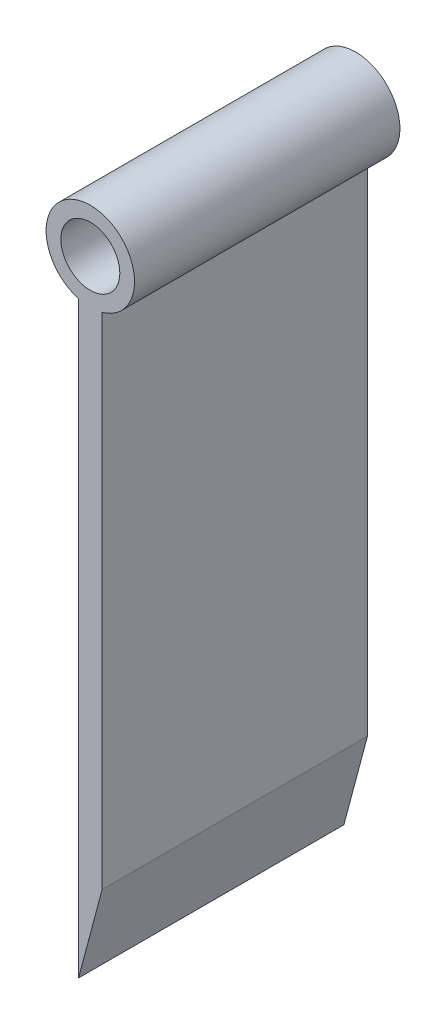
ISO-10303-21;
HEADER;
FILE_DESCRIPTION(('STEP AP214'),'2;1');
FILE_NAME('part.step','',(''),(''),'','','');
FILE_SCHEMA(('AUTOMOTIVE_DESIGN { 1 0 10303 214 1 1 1 1 }'));
ENDSEC;
DATA;
#1=APPLICATION_CONTEXT('core data for automotive mechanical design processes');
#2=APPLICATION_PROTOCOL_DEFINITION('international standard','automotive_design',2000,#1);
#3=PRODUCT_CONTEXT('',#1,'mechanical');
#4=PRODUCT('Part','Part','',(#3));
#5=PRODUCT_RELATED_PRODUCT_CATEGORY('part','',(#4));
#6=PRODUCT_DEFINITION_FORMATION('','',#4);
#7=PRODUCT_DEFINITION_CONTEXT('part definition',#1,'design');
#8=PRODUCT_DEFINITION('design','',#6,#7);
#9=PRODUCT_DEFINITION_SHAPE('','',#8);
#10=(LENGTH_UNIT() NAMED_UNIT(*) SI_UNIT(.MILLI.,.METRE.));
#11=(NAMED_UNIT(*) PLANE_ANGLE_UNIT() SI_UNIT($,.RADIAN.));
#12=(NAMED_UNIT(*) SI_UNIT($,.STERADIAN.) SOLID_ANGLE_UNIT());
#13=UNCERTAINTY_MEASURE_WITH_UNIT(LENGTH_MEASURE(1.E-05),#10,'distance_accuracy_value','');
#14=(GEOMETRIC_REPRESENTATION_CONTEXT(3) GLOBAL_UNCERTAINTY_ASSIGNED_CONTEXT((#13)) GLOBAL_UNIT_ASSIGNED_CONTEXT((#10,
#11,#12)) REPRESENTATION_CONTEXT('',''));
#15=CARTESIAN_POINT('',(0.,0.,0.));
#16=DIRECTION('',(0.,0.,1.));
#17=DIRECTION('',(1.,0.,0.));
#18=AXIS2_PLACEMENT_3D('',#15,#16,#17);
#19=CARTESIAN_POINT('',(1.,53.5,22.5));
#20=DIRECTION('',(0.,0.,-1.));
#21=DIRECTION('',(-1.,0.,0.));
#22=AXIS2_PLACEMENT_3D('',#19,#20,#21);
#23=CYLINDRICAL_SURFACE('',#22,3.75);
#24=CARTESIAN_POINT('',(1.,53.5,0.));
#25=DIRECTION('',(0.,0.,1.));
#26=DIRECTION('',(1.,0.,0.));
#27=AXIS2_PLACEMENT_3D('',#24,#25,#26);
#28=CIRCLE('',#27,3.75);
#29=CARTESIAN_POINT('',(2.,49.8857919262998,0.));
#30=VERTEX_POINT('',#29);
#31=CARTESIAN_POINT('',(0.,49.8857919262998,0.));
#32=VERTEX_POINT('',#31);
#33=EDGE_CURVE('E102',#30,#32,#28,.T.);
#34=ORIENTED_EDGE('',*,*,#33,.T.);
#35=DIRECTION('',(0.,0.,-1.));
#36=VECTOR('',#35,1.);
#37=CARTESIAN_POINT('',(0.,49.8857919262998,22.5));
#38=LINE('',#37,#36);
#39=CARTESIAN_POINT('',(0.,49.8857919262998,22.5));
#40=VERTEX_POINT('',#39);
#41=EDGE_CURVE('E11',#40,#32,#38,.T.);
#42=ORIENTED_EDGE('',*,*,#41,.F.);
#43=CARTESIAN_POINT('',(1.,53.5,22.5));
#44=DIRECTION('',(0.,0.,1.));
#45=DIRECTION('',(1.,0.,0.));
#46=AXIS2_PLACEMENT_3D('',#43,#44,#45);
#47=CIRCLE('',#46,3.75);
#48=CARTESIAN_POINT('',(2.,49.8857919262998,22.5));
#49=VERTEX_POINT('',#48);
#50=EDGE_CURVE('E76',#49,#40,#47,.T.);
#51=ORIENTED_EDGE('',*,*,#50,.F.);
#52=DIRECTION('',(0.,0.,-1.));
#53=VECTOR('',#52,1.);
#54=CARTESIAN_POINT('',(2.,49.8857919262998,22.5));
#55=LINE('',#54,#53);
#56=EDGE_CURVE('E52',#49,#30,#55,.T.);
#57=ORIENTED_EDGE('',*,*,#56,.T.);
#58=EDGE_LOOP('',(#34,#42,#51,#57));
#59=FACE_BOUND('',#58,.T.);
#60=ADVANCED_FACE('F35',(#59),#23,.T.);
#61=CARTESIAN_POINT('',(0.,0.,22.5));
#62=DIRECTION('',(-1.,0.,0.));
#63=DIRECTION('',(0.,0.,1.));
#64=AXIS2_PLACEMENT_3D('',#61,#62,#63);
#65=PLANE('',#64);
#66=DIRECTION('',(0.,1.,0.));
#67=VECTOR('',#66,1.);
#68=CARTESIAN_POINT('',(0.,0.,0.));
#69=LINE('',#68,#67);
#70=CARTESIAN_POINT('',(0.,0.,0.));
#71=VERTEX_POINT('',#70);
#72=EDGE_CURVE('E85',#71,#32,#69,.T.);
#73=ORIENTED_EDGE('',*,*,#72,.F.);
#74=DIRECTION('',(0.,0.,-1.));
#75=VECTOR('',#74,1.);
#76=CARTESIAN_POINT('',(0.,0.,22.5));
#77=LINE('',#76,#75);
#78=CARTESIAN_POINT('',(0.,0.,22.5));
#79=VERTEX_POINT('',#78);
#80=EDGE_CURVE('E44',#79,#71,#77,.T.);
#81=ORIENTED_EDGE('',*,*,#80,.F.);
#82=DIRECTION('',(0.,1.,0.));
#83=VECTOR('',#82,1.);
#84=CARTESIAN_POINT('',(0.,0.,22.5));
#85=LINE('',#84,#83);
#86=EDGE_CURVE('E83',#79,#40,#85,.T.);
#87=ORIENTED_EDGE('',*,*,#86,.T.);
#88=ORIENTED_EDGE('',*,*,#41,.T.);
#89=EDGE_LOOP('',(#73,#81,#87,#88));
#90=FACE_BOUND('',#89,.T.);
#91=ADVANCED_FACE('F82',(#90),#65,.T.);
#92=CARTESIAN_POINT('',(0.,0.,22.5));
#93=DIRECTION('',(0.966234939601246,-0.257662650560333,0.));
#94=DIRECTION('',(0.257662650560333,0.966234939601246,0.));
#95=AXIS2_PLACEMENT_3D('',#92,#93,#94);
#96=PLANE('',#95);
#97=DIRECTION('',(-0.257662650560333,-0.966234939601246,0.));
#98=VECTOR('',#97,1.);
#99=CARTESIAN_POINT('',(0.,0.,0.));
#100=LINE('',#99,#98);
#101=CARTESIAN_POINT('',(2.00000000000001,7.50000000000001,0.));
#102=VERTEX_POINT('',#101);
#103=EDGE_CURVE('E105',#102,#71,#100,.T.);
#104=ORIENTED_EDGE('',*,*,#103,.F.);
#105=DIRECTION('',(0.,0.,-1.));
#106=VECTOR('',#105,1.);
#107=CARTESIAN_POINT('',(2.00000000000001,7.50000000000001,22.5));
#108=LINE('',#107,#106);
#109=CARTESIAN_POINT('',(2.00000000000001,7.50000000000001,22.5));
#110=VERTEX_POINT('',#109);
#111=EDGE_CURVE('E65',#110,#102,#108,.T.);
#112=ORIENTED_EDGE('',*,*,#111,.F.);
#113=DIRECTION('',(-0.257662650560333,-0.966234939601246,0.));
#114=VECTOR('',#113,1.);
#115=CARTESIAN_POINT('',(0.,0.,22.5));
#116=LINE('',#115,#114);
#117=EDGE_CURVE('E91',#110,#79,#116,.T.);
#118=ORIENTED_EDGE('',*,*,#117,.T.);
#119=ORIENTED_EDGE('',*,*,#80,.T.);
#120=EDGE_LOOP('',(#104,#112,#118,#119));
#121=FACE_BOUND('',#120,.T.);
#122=ADVANCED_FACE('F93',(#121),#96,.T.);
#123=CARTESIAN_POINT('',(1.,53.5,22.5));
#124=DIRECTION('',(0.,0.,-1.));
#125=DIRECTION('',(-1.,0.,0.));
#126=AXIS2_PLACEMENT_3D('',#123,#124,#125);
#127=CYLINDRICAL_SURFACE('',#126,2.5);
#128=CARTESIAN_POINT('',(1.,53.5,22.5));
#129=DIRECTION('',(0.,0.,1.));
#130=DIRECTION('',(1.,0.,0.));
#131=AXIS2_PLACEMENT_3D('',#128,#129,#130);
#132=CIRCLE('',#131,2.5);
#133=CARTESIAN_POINT('',(3.5,53.5,22.5));
#134=VERTEX_POINT('',#133);
#135=EDGE_CURVE('E110',#134,#134,#132,.T.);
#136=ORIENTED_EDGE('',*,*,#135,.T.);
#137=EDGE_LOOP('',(#136));
#138=FACE_BOUND('',#137,.T.);
#139=CARTESIAN_POINT('',(1.,53.5,0.));
#140=DIRECTION('',(0.,0.,1.));
#141=DIRECTION('',(1.,0.,0.));
#142=AXIS2_PLACEMENT_3D('',#139,#140,#141);
#143=CIRCLE('',#142,2.5);
#144=CARTESIAN_POINT('',(3.5,53.5,0.));
#145=VERTEX_POINT('',#144);
#146=EDGE_CURVE('E99',#145,#145,#143,.T.);
#147=ORIENTED_EDGE('',*,*,#146,.F.);
#148=EDGE_LOOP('',(#147));
#149=FACE_BOUND('',#148,.T.);
#150=ADVANCED_FACE('F37',(#138,#149),#127,.F.);
#151=CARTESIAN_POINT('',(2.00000000000001,0.,22.5));
#152=DIRECTION('',(1.,0.,0.));
#153=DIRECTION('',(0.,1.,0.));
#154=AXIS2_PLACEMENT_3D('',#151,#152,#153);
#155=PLANE('',#154);
#156=DIRECTION('',(0.,-1.,0.));
#157=VECTOR('',#156,1.);
#158=CARTESIAN_POINT('',(2.00000000000001,0.,0.));
#159=LINE('',#158,#157);
#160=EDGE_CURVE('E107',#30,#102,#159,.T.);
#161=ORIENTED_EDGE('',*,*,#160,.F.);
#162=ORIENTED_EDGE('',*,*,#56,.F.);
#163=DIRECTION('',(0.,-1.,0.));
#164=VECTOR('',#163,1.);
#165=CARTESIAN_POINT('',(2.00000000000001,0.,22.5));
#166=LINE('',#165,#164);
#167=EDGE_CURVE('E94',#49,#110,#166,.T.);
#168=ORIENTED_EDGE('',*,*,#167,.T.);
#169=ORIENTED_EDGE('',*,*,#111,.T.);
#170=EDGE_LOOP('',(#161,#162,#168,#169));
#171=FACE_BOUND('',#170,.T.);
#172=ADVANCED_FACE('F121',(#171),#155,.T.);
#173=CARTESIAN_POINT('',(0.,0.,22.5));
#174=DIRECTION('',(0.,0.,1.));
#175=DIRECTION('',(1.,0.,0.));
#176=AXIS2_PLACEMENT_3D('',#173,#174,#175);
#177=PLANE('',#176);
#178=ORIENTED_EDGE('',*,*,#135,.F.);
#179=EDGE_LOOP('',(#178));
#180=FACE_BOUND('',#179,.T.);
#181=ORIENTED_EDGE('',*,*,#50,.T.);
#182=ORIENTED_EDGE('',*,*,#86,.F.);
#183=ORIENTED_EDGE('',*,*,#117,.F.);
#184=ORIENTED_EDGE('',*,*,#167,.F.);
#185=EDGE_LOOP('',(#181,#182,#183,#184));
#186=FACE_BOUND('',#185,.T.);
#187=ADVANCED_FACE('F90',(#180,#186),#177,.T.);
#188=CARTESIAN_POINT('',(0.,0.,0.));
#189=DIRECTION('',(0.,0.,1.));
#190=DIRECTION('',(1.,0.,0.));
#191=AXIS2_PLACEMENT_3D('',#188,#189,#190);
#192=PLANE('',#191);
#193=ORIENTED_EDGE('',*,*,#146,.T.);
#194=EDGE_LOOP('',(#193));
#195=FACE_BOUND('',#194,.T.);
#196=ORIENTED_EDGE('',*,*,#33,.F.);
#197=ORIENTED_EDGE('',*,*,#160,.T.);
#198=ORIENTED_EDGE('',*,*,#103,.T.);
#199=ORIENTED_EDGE('',*,*,#72,.T.);
#200=EDGE_LOOP('',(#196,#197,#198,#199));
#201=FACE_BOUND('',#200,.T.);
#202=ADVANCED_FACE('F120',(#195,#201),#192,.F.);
#203=CLOSED_SHELL('',(#60,#91,#122,#150,#172,#187,#202));
#204=MANIFOLD_SOLID_BREP('B2',#203);
#205=ADVANCED_BREP_SHAPE_REPRESENTATION('',(#18,#204),#14);
#206=SHAPE_DEFINITION_REPRESENTATION(#9,#205);
ENDSEC;
END-ISO-10303-21;
